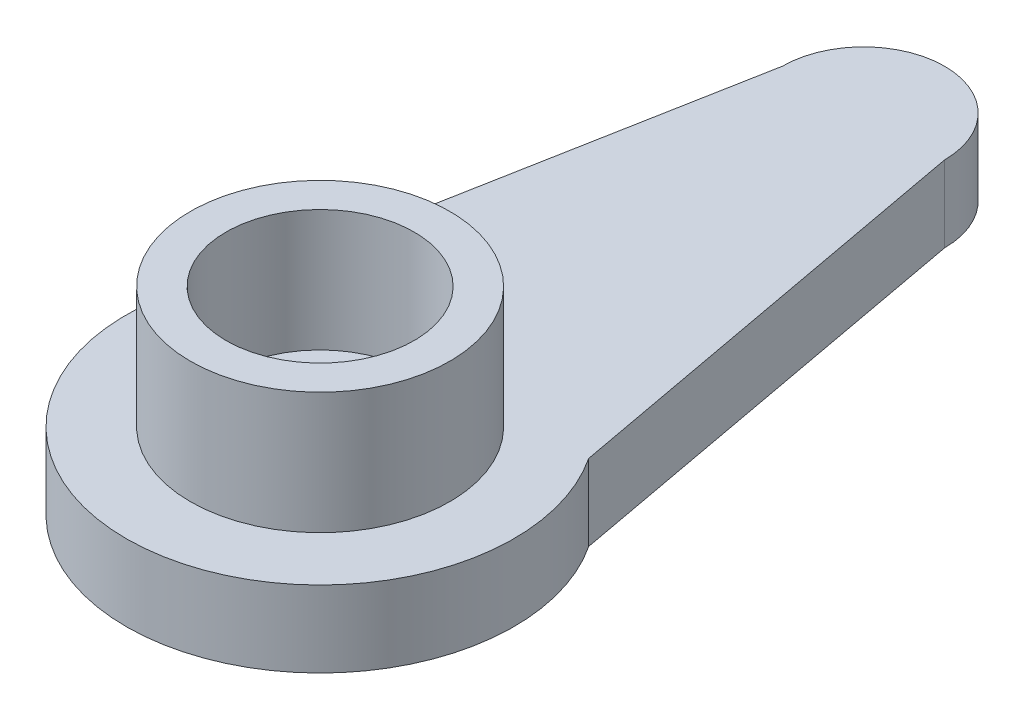
ISO-10303-21;
HEADER;
FILE_DESCRIPTION(('STEP AP214'),'2;1');
FILE_NAME('part.step','',(''),(''),'','','');
FILE_SCHEMA(('AUTOMOTIVE_DESIGN { 1 0 10303 214 1 1 1 1 }'));
ENDSEC;
DATA;
#1=APPLICATION_CONTEXT('core data for automotive mechanical design processes');
#2=APPLICATION_PROTOCOL_DEFINITION('international standard','automotive_design',2000,#1);
#3=PRODUCT_CONTEXT('',#1,'mechanical');
#4=PRODUCT('Part','Part','',(#3));
#5=PRODUCT_RELATED_PRODUCT_CATEGORY('part','',(#4));
#6=PRODUCT_DEFINITION_FORMATION('','',#4);
#7=PRODUCT_DEFINITION_CONTEXT('part definition',#1,'design');
#8=PRODUCT_DEFINITION('design','',#6,#7);
#9=PRODUCT_DEFINITION_SHAPE('','',#8);
#10=(LENGTH_UNIT() NAMED_UNIT(*) SI_UNIT(.MILLI.,.METRE.));
#11=(NAMED_UNIT(*) PLANE_ANGLE_UNIT() SI_UNIT($,.RADIAN.));
#12=(NAMED_UNIT(*) SI_UNIT($,.STERADIAN.) SOLID_ANGLE_UNIT());
#13=UNCERTAINTY_MEASURE_WITH_UNIT(LENGTH_MEASURE(1.E-05),#10,'distance_accuracy_value','');
#14=(GEOMETRIC_REPRESENTATION_CONTEXT(3) GLOBAL_UNCERTAINTY_ASSIGNED_CONTEXT((#13)) GLOBAL_UNIT_ASSIGNED_CONTEXT((#10,
#11,#12)) REPRESENTATION_CONTEXT('',''));
#15=CARTESIAN_POINT('',(0.,0.,0.));
#16=DIRECTION('',(0.,0.,1.));
#17=DIRECTION('',(1.,0.,0.));
#18=AXIS2_PLACEMENT_3D('',#15,#16,#17);
#19=CARTESIAN_POINT('',(0.,2.35,0.));
#20=DIRECTION('',(0.,1.,0.));
#21=DIRECTION('',(0.,0.,1.));
#22=AXIS2_PLACEMENT_3D('',#19,#20,#21);
#23=PLANE('',#22);
#24=CARTESIAN_POINT('',(0.,2.35,0.));
#25=DIRECTION('',(0.,1.,0.));
#26=DIRECTION('',(0.,0.,1.));
#27=AXIS2_PLACEMENT_3D('',#24,#25,#26);
#28=CIRCLE('',#27,1.55);
#29=CARTESIAN_POINT('',(0.,2.35,1.55));
#30=VERTEX_POINT('',#29);
#31=EDGE_CURVE('E97',#30,#30,#28,.T.);
#32=ORIENTED_EDGE('',*,*,#31,.F.);
#33=EDGE_LOOP('',(#32));
#34=FACE_BOUND('',#33,.T.);
#35=CARTESIAN_POINT('',(0.,2.35,0.));
#36=DIRECTION('',(0.,1.,0.));
#37=DIRECTION('',(0.,0.,1.));
#38=AXIS2_PLACEMENT_3D('',#35,#36,#37);
#39=CIRCLE('',#38,2.9);
#40=CARTESIAN_POINT('',(0.,2.35,2.9));
#41=VERTEX_POINT('',#40);
#42=EDGE_CURVE('E11',#41,#41,#39,.F.);
#43=ORIENTED_EDGE('',*,*,#42,.F.);
#44=EDGE_LOOP('',(#43));
#45=FACE_BOUND('',#44,.T.);
#46=ADVANCED_FACE('F34',(#34,#45),#23,.T.);
#47=CARTESIAN_POINT('',(5.40842110420146,2.35,-0.998641893174387));
#48=DIRECTION('',(0.9833768514608,0.,-0.181576342101727));
#49=DIRECTION('',(-0.181576342101727,0.,-0.9833768514608));
#50=AXIS2_PLACEMENT_3D('',#47,#48,#49);
#51=PLANE('',#50);
#52=DIRECTION('',(0.181576342101727,0.,0.9833768514608));
#53=VECTOR('',#52,1.);
#54=CARTESIAN_POINT('',(5.40842110420146,0.,-0.998641893174387));
#55=LINE('',#54,#53);
#56=CARTESIAN_POINT('',(2.5,0.,-16.75));
#57=VERTEX_POINT('',#56);
#58=CARTESIAN_POINT('',(4.98443663111155,0.,-3.29484695705785));
#59=VERTEX_POINT('',#58);
#60=EDGE_CURVE('E103',#57,#59,#55,.T.);
#61=ORIENTED_EDGE('',*,*,#60,.F.);
#62=DIRECTION('',(0.,-1.,0.));
#63=VECTOR('',#62,1.);
#64=CARTESIAN_POINT('',(2.5,2.35,-16.75));
#65=LINE('',#64,#63);
#66=CARTESIAN_POINT('',(2.5,2.35,-16.75));
#67=VERTEX_POINT('',#66);
#68=EDGE_CURVE('E38',#67,#57,#65,.T.);
#69=ORIENTED_EDGE('',*,*,#68,.F.);
#70=DIRECTION('',(0.181576342101727,0.,0.9833768514608));
#71=VECTOR('',#70,1.);
#72=CARTESIAN_POINT('',(5.40842110420146,2.35,-0.998641893174387));
#73=LINE('',#72,#71);
#74=CARTESIAN_POINT('',(4.98443663111155,2.35,-3.29484695705785));
#75=VERTEX_POINT('',#74);
#76=EDGE_CURVE('E87',#67,#75,#73,.T.);
#77=ORIENTED_EDGE('',*,*,#76,.T.);
#78=DIRECTION('',(0.,-1.,0.));
#79=VECTOR('',#78,1.);
#80=CARTESIAN_POINT('',(4.98443663111155,2.35,-3.29484695705785));
#81=LINE('',#80,#79);
#82=EDGE_CURVE('E76',#75,#59,#81,.T.);
#83=ORIENTED_EDGE('',*,*,#82,.T.);
#84=EDGE_LOOP('',(#61,#69,#77,#83));
#85=FACE_BOUND('',#84,.T.);
#86=ADVANCED_FACE('F36',(#85),#51,.T.);
#87=CARTESIAN_POINT('',(0.,2.35,-16.75));
#88=DIRECTION('',(0.,-1.,0.));
#89=DIRECTION('',(0.,0.,-1.));
#90=AXIS2_PLACEMENT_3D('',#87,#88,#89);
#91=CYLINDRICAL_SURFACE('',#90,2.5);
#92=CARTESIAN_POINT('',(0.,0.,-16.75));
#93=DIRECTION('',(0.,1.,0.));
#94=DIRECTION('',(0.,0.,1.));
#95=AXIS2_PLACEMENT_3D('',#92,#93,#94);
#96=CIRCLE('',#95,2.5);
#97=CARTESIAN_POINT('',(-2.5,0.,-16.75));
#98=VERTEX_POINT('',#97);
#99=EDGE_CURVE('E93',#57,#98,#96,.T.);
#100=ORIENTED_EDGE('',*,*,#99,.T.);
#101=DIRECTION('',(0.,-1.,0.));
#102=VECTOR('',#101,1.);
#103=CARTESIAN_POINT('',(-2.5,2.35,-16.75));
#104=LINE('',#103,#102);
#105=CARTESIAN_POINT('',(-2.5,2.35,-16.75));
#106=VERTEX_POINT('',#105);
#107=EDGE_CURVE('E90',#106,#98,#104,.T.);
#108=ORIENTED_EDGE('',*,*,#107,.F.);
#109=CARTESIAN_POINT('',(0.,2.35,-16.75));
#110=DIRECTION('',(0.,1.,0.));
#111=DIRECTION('',(0.,0.,1.));
#112=AXIS2_PLACEMENT_3D('',#109,#110,#111);
#113=CIRCLE('',#112,2.5);
#114=EDGE_CURVE('E82',#67,#106,#113,.T.);
#115=ORIENTED_EDGE('',*,*,#114,.F.);
#116=ORIENTED_EDGE('',*,*,#68,.T.);
#117=EDGE_LOOP('',(#100,#108,#115,#116));
#118=FACE_BOUND('',#117,.T.);
#119=ADVANCED_FACE('F91',(#118),#91,.T.);
#120=CARTESIAN_POINT('',(-5.43191333483784,2.35,-1.01193502270247));
#121=DIRECTION('',(0.98308619978412,0.,0.183143451409047));
#122=DIRECTION('',(0.183143451409047,0.,-0.98308619978412));
#123=AXIS2_PLACEMENT_3D('',#120,#121,#122);
#124=PLANE('',#123);
#125=DIRECTION('',(-0.183143451409047,0.,0.98308619978412));
#126=VECTOR('',#125,1.);
#127=CARTESIAN_POINT('',(-5.43191333483784,0.,-1.01193502270247));
#128=LINE('',#127,#126);
#129=CARTESIAN_POINT('',(-5.01545100433607,0.,-3.24744148878841));
#130=VERTEX_POINT('',#129);
#131=EDGE_CURVE('E69',#98,#130,#128,.T.);
#132=ORIENTED_EDGE('',*,*,#131,.T.);
#133=DIRECTION('',(0.,-1.,0.));
#134=VECTOR('',#133,1.);
#135=CARTESIAN_POINT('',(-5.01545100433607,2.35,-3.24744148878841));
#136=LINE('',#135,#134);
#137=CARTESIAN_POINT('',(-5.01545100433607,2.35,-3.24744148878841));
#138=VERTEX_POINT('',#137);
#139=EDGE_CURVE('E94',#138,#130,#136,.T.);
#140=ORIENTED_EDGE('',*,*,#139,.F.);
#141=DIRECTION('',(-0.183143451409047,0.,0.98308619978412));
#142=VECTOR('',#141,1.);
#143=CARTESIAN_POINT('',(-5.43191333483784,2.35,-1.01193502270247));
#144=LINE('',#143,#142);
#145=EDGE_CURVE('E86',#106,#138,#144,.T.);
#146=ORIENTED_EDGE('',*,*,#145,.F.);
#147=ORIENTED_EDGE('',*,*,#107,.T.);
#148=EDGE_LOOP('',(#132,#140,#146,#147));
#149=FACE_BOUND('',#148,.T.);
#150=ADVANCED_FACE('F95',(#149),#124,.F.);
#151=CARTESIAN_POINT('',(0.,2.35,0.));
#152=DIRECTION('',(0.,-1.,0.));
#153=DIRECTION('',(0.,0.,-1.));
#154=AXIS2_PLACEMENT_3D('',#151,#152,#153);
#155=CYLINDRICAL_SURFACE('',#154,5.975);
#156=CARTESIAN_POINT('',(0.,0.,0.));
#157=DIRECTION('',(0.,1.,0.));
#158=DIRECTION('',(0.,0.,1.));
#159=AXIS2_PLACEMENT_3D('',#156,#157,#158);
#160=CIRCLE('',#159,5.975);
#161=EDGE_CURVE('E109',#130,#59,#160,.T.);
#162=ORIENTED_EDGE('',*,*,#161,.T.);
#163=ORIENTED_EDGE('',*,*,#82,.F.);
#164=CARTESIAN_POINT('',(0.,2.35,0.));
#165=DIRECTION('',(0.,1.,0.));
#166=DIRECTION('',(0.,0.,1.));
#167=AXIS2_PLACEMENT_3D('',#164,#165,#166);
#168=CIRCLE('',#167,5.975);
#169=EDGE_CURVE('E52',#138,#75,#168,.T.);
#170=ORIENTED_EDGE('',*,*,#169,.F.);
#171=ORIENTED_EDGE('',*,*,#139,.T.);
#172=EDGE_LOOP('',(#162,#163,#170,#171));
#173=FACE_BOUND('',#172,.T.);
#174=ADVANCED_FACE('F117',(#173),#155,.T.);
#175=CARTESIAN_POINT('',(0.,2.35,0.));
#176=DIRECTION('',(0.,-1.,0.));
#177=DIRECTION('',(0.,0.,-1.));
#178=AXIS2_PLACEMENT_3D('',#175,#176,#177);
#179=CYLINDRICAL_SURFACE('',#178,1.55);
#180=ORIENTED_EDGE('',*,*,#31,.T.);
#181=EDGE_LOOP('',(#180));
#182=FACE_BOUND('',#181,.T.);
#183=CARTESIAN_POINT('',(0.,0.,0.));
#184=DIRECTION('',(0.,1.,0.));
#185=DIRECTION('',(0.,0.,1.));
#186=AXIS2_PLACEMENT_3D('',#183,#184,#185);
#187=CIRCLE('',#186,1.55);
#188=CARTESIAN_POINT('',(0.,0.,1.55));
#189=VERTEX_POINT('',#188);
#190=EDGE_CURVE('E111',#189,#189,#187,.T.);
#191=ORIENTED_EDGE('',*,*,#190,.F.);
#192=EDGE_LOOP('',(#191));
#193=FACE_BOUND('',#192,.T.);
#194=ADVANCED_FACE('F135',(#182,#193),#179,.F.);
#195=CARTESIAN_POINT('',(0.,2.35,0.));
#196=DIRECTION('',(0.,1.,0.));
#197=DIRECTION('',(0.,0.,1.));
#198=AXIS2_PLACEMENT_3D('',#195,#196,#197);
#199=CIRCLE('',#198,4.);
#200=CARTESIAN_POINT('',(0.,2.35,4.));
#201=VERTEX_POINT('',#200);
#202=EDGE_CURVE('E106',#201,#201,#199,.F.);
#203=ORIENTED_EDGE('',*,*,#202,.T.);
#204=EDGE_LOOP('',(#203));
#205=FACE_BOUND('',#204,.T.);
#206=ORIENTED_EDGE('',*,*,#76,.F.);
#207=ORIENTED_EDGE('',*,*,#114,.T.);
#208=ORIENTED_EDGE('',*,*,#145,.T.);
#209=ORIENTED_EDGE('',*,*,#169,.T.);
#210=EDGE_LOOP('',(#206,#207,#208,#209));
#211=FACE_BOUND('',#210,.T.);
#212=ADVANCED_FACE('F84',(#205,#211),#23,.T.);
#213=CARTESIAN_POINT('',(0.,0.,0.));
#214=DIRECTION('',(0.,1.,0.));
#215=DIRECTION('',(0.,0.,1.));
#216=AXIS2_PLACEMENT_3D('',#213,#214,#215);
#217=PLANE('',#216);
#218=ORIENTED_EDGE('',*,*,#60,.T.);
#219=ORIENTED_EDGE('',*,*,#161,.F.);
#220=ORIENTED_EDGE('',*,*,#131,.F.);
#221=ORIENTED_EDGE('',*,*,#99,.F.);
#222=EDGE_LOOP('',(#218,#219,#220,#221));
#223=FACE_BOUND('',#222,.T.);
#224=ORIENTED_EDGE('',*,*,#190,.T.);
#225=EDGE_LOOP('',(#224));
#226=FACE_BOUND('',#225,.T.);
#227=ADVANCED_FACE('F119',(#223,#226),#217,.F.);
#228=CARTESIAN_POINT('',(0.,6.1,0.));
#229=DIRECTION('',(0.,-1.,0.));
#230=DIRECTION('',(0.,0.,-1.));
#231=AXIS2_PLACEMENT_3D('',#228,#229,#230);
#232=CYLINDRICAL_SURFACE('',#231,4.);
#233=ORIENTED_EDGE('',*,*,#202,.F.);
#234=EDGE_LOOP('',(#233));
#235=FACE_BOUND('',#234,.T.);
#236=CARTESIAN_POINT('',(0.,6.1,0.));
#237=DIRECTION('',(0.,1.,0.));
#238=DIRECTION('',(0.,0.,1.));
#239=AXIS2_PLACEMENT_3D('',#236,#237,#238);
#240=CIRCLE('',#239,4.);
#241=CARTESIAN_POINT('',(0.,6.1,4.));
#242=VERTEX_POINT('',#241);
#243=EDGE_CURVE('E150',#242,#242,#240,.T.);
#244=ORIENTED_EDGE('',*,*,#243,.F.);
#245=EDGE_LOOP('',(#244));
#246=FACE_BOUND('',#245,.T.);
#247=ADVANCED_FACE('F141',(#235,#246),#232,.T.);
#248=CARTESIAN_POINT('',(0.,6.1,0.));
#249=DIRECTION('',(0.,-1.,0.));
#250=DIRECTION('',(0.,0.,-1.));
#251=AXIS2_PLACEMENT_3D('',#248,#249,#250);
#252=CYLINDRICAL_SURFACE('',#251,2.9);
#253=ORIENTED_EDGE('',*,*,#42,.T.);
#254=EDGE_LOOP('',(#253));
#255=FACE_BOUND('',#254,.T.);
#256=CARTESIAN_POINT('',(0.,6.1,0.));
#257=DIRECTION('',(0.,1.,0.));
#258=DIRECTION('',(0.,0.,1.));
#259=AXIS2_PLACEMENT_3D('',#256,#257,#258);
#260=CIRCLE('',#259,2.9);
#261=CARTESIAN_POINT('',(0.,6.1,2.9));
#262=VERTEX_POINT('',#261);
#263=EDGE_CURVE('E147',#262,#262,#260,.T.);
#264=ORIENTED_EDGE('',*,*,#263,.T.);
#265=EDGE_LOOP('',(#264));
#266=FACE_BOUND('',#265,.T.);
#267=ADVANCED_FACE('F160',(#255,#266),#252,.F.);
#268=CARTESIAN_POINT('',(0.,6.1,0.));
#269=DIRECTION('',(0.,1.,0.));
#270=DIRECTION('',(0.,0.,1.));
#271=AXIS2_PLACEMENT_3D('',#268,#269,#270);
#272=PLANE('',#271);
#273=ORIENTED_EDGE('',*,*,#243,.T.);
#274=EDGE_LOOP('',(#273));
#275=FACE_BOUND('',#274,.T.);
#276=ORIENTED_EDGE('',*,*,#263,.F.);
#277=EDGE_LOOP('',(#276));
#278=FACE_BOUND('',#277,.T.);
#279=ADVANCED_FACE('F156',(#275,#278),#272,.T.);
#280=CLOSED_SHELL('',(#46,#86,#119,#150,#174,#194,#212,#227,#247,#267,#279));
#281=MANIFOLD_SOLID_BREP('B2',#280);
#282=ADVANCED_BREP_SHAPE_REPRESENTATION('',(#18,#281),#14);
#283=SHAPE_DEFINITION_REPRESENTATION(#9,#282);
ENDSEC;
END-ISO-10303-21;
